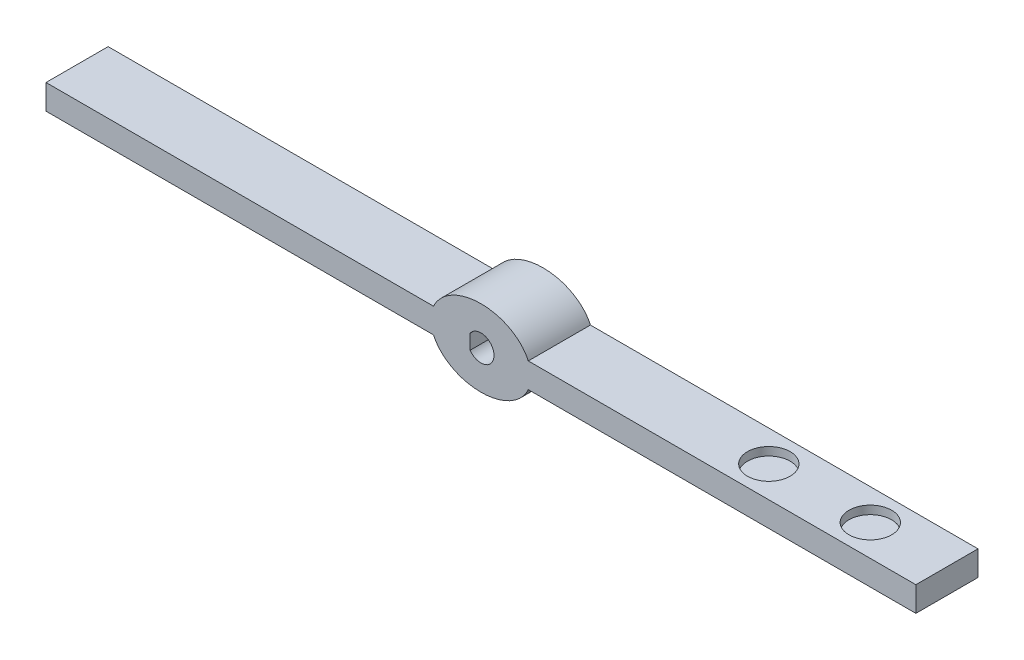
ISO-10303-21;
HEADER;
FILE_DESCRIPTION(('STEP AP214'),'2;1');
FILE_NAME('part.step','',(''),(''),'','','');
FILE_SCHEMA(('AUTOMOTIVE_DESIGN { 1 0 10303 214 1 1 1 1 }'));
ENDSEC;
DATA;
#1=APPLICATION_CONTEXT('core data for automotive mechanical design processes');
#2=APPLICATION_PROTOCOL_DEFINITION('international standard','automotive_design',2000,#1);
#3=PRODUCT_CONTEXT('',#1,'mechanical');
#4=PRODUCT('Part','Part','',(#3));
#5=PRODUCT_RELATED_PRODUCT_CATEGORY('part','',(#4));
#6=PRODUCT_DEFINITION_FORMATION('','',#4);
#7=PRODUCT_DEFINITION_CONTEXT('part definition',#1,'design');
#8=PRODUCT_DEFINITION('design','',#6,#7);
#9=PRODUCT_DEFINITION_SHAPE('','',#8);
#10=(LENGTH_UNIT() NAMED_UNIT(*) SI_UNIT(.MILLI.,.METRE.));
#11=(NAMED_UNIT(*) PLANE_ANGLE_UNIT() SI_UNIT($,.RADIAN.));
#12=(NAMED_UNIT(*) SI_UNIT($,.STERADIAN.) SOLID_ANGLE_UNIT());
#13=UNCERTAINTY_MEASURE_WITH_UNIT(LENGTH_MEASURE(1.E-05),#10,'distance_accuracy_value','');
#14=(GEOMETRIC_REPRESENTATION_CONTEXT(3) GLOBAL_UNCERTAINTY_ASSIGNED_CONTEXT((#13)) GLOBAL_UNIT_ASSIGNED_CONTEXT((#10,
#11,#12)) REPRESENTATION_CONTEXT('',''));
#15=CARTESIAN_POINT('',(0.,0.,0.));
#16=DIRECTION('',(0.,0.,1.));
#17=DIRECTION('',(1.,0.,0.));
#18=AXIS2_PLACEMENT_3D('',#15,#16,#17);
#19=CARTESIAN_POINT('',(-85.2552926525529,15.1830635118306,15.));
#20=DIRECTION('',(0.,1.,0.));
#21=DIRECTION('',(0.,0.,1.));
#22=AXIS2_PLACEMENT_3D('',#19,#20,#21);
#23=PLANE('',#22);
#24=CARTESIAN_POINT('',(-42.2552926525529,15.1830635118306,7.5));
#25=DIRECTION('',(0.,-1.,0.));
#26=DIRECTION('',(0.,0.,-1.));
#27=AXIS2_PLACEMENT_3D('',#24,#25,#26);
#28=CIRCLE('',#27,5.15);
#29=CARTESIAN_POINT('',(-42.2552926525529,15.1830635118306,2.35));
#30=VERTEX_POINT('',#29);
#31=EDGE_CURVE('E144',#30,#30,#28,.T.);
#32=ORIENTED_EDGE('',*,*,#31,.F.);
#33=EDGE_LOOP('',(#32));
#34=FACE_BOUND('',#33,.T.);
#35=CARTESIAN_POINT('',(-66.755292652553,15.1830635118306,7.49999999999983));
#36=DIRECTION('',(0.,-1.,0.));
#37=DIRECTION('',(0.,0.,-1.));
#38=AXIS2_PLACEMENT_3D('',#35,#36,#37);
#39=CIRCLE('',#38,5.15000000000001);
#40=CARTESIAN_POINT('',(-66.755292652553,15.1830635118306,2.34999999999982));
#41=VERTEX_POINT('',#40);
#42=EDGE_CURVE('E205',#41,#41,#39,.T.);
#43=ORIENTED_EDGE('',*,*,#42,.F.);
#44=EDGE_LOOP('',(#43));
#45=FACE_BOUND('',#44,.T.);
#46=DIRECTION('',(1.,0.,0.));
#47=VECTOR('',#46,1.);
#48=CARTESIAN_POINT('',(-85.2552926525529,15.1830635118306,0.));
#49=LINE('',#48,#47);
#50=CARTESIAN_POINT('',(-85.2552926525529,15.1830635118306,0.));
#51=VERTEX_POINT('',#50);
#52=CARTESIAN_POINT('',(8.31177794922894,15.1830635118306,0.));
#53=VERTEX_POINT('',#52);
#54=EDGE_CURVE('E208',#51,#53,#49,.T.);
#55=ORIENTED_EDGE('',*,*,#54,.T.);
#56=DIRECTION('',(0.,0.,1.));
#57=VECTOR('',#56,1.);
#58=CARTESIAN_POINT('',(8.31177794922894,15.1830635118306,0.));
#59=LINE('',#58,#57);
#60=CARTESIAN_POINT('',(8.31177794922894,15.1830635118306,15.));
#61=VERTEX_POINT('',#60);
#62=EDGE_CURVE('E209',#53,#61,#59,.T.);
#63=ORIENTED_EDGE('',*,*,#62,.T.);
#64=DIRECTION('',(1.,0.,0.));
#65=VECTOR('',#64,1.);
#66=CARTESIAN_POINT('',(-85.2552926525529,15.1830635118306,15.));
#67=LINE('',#66,#65);
#68=CARTESIAN_POINT('',(-85.2552926525529,15.1830635118306,15.));
#69=VERTEX_POINT('',#68);
#70=EDGE_CURVE('E263',#69,#61,#67,.T.);
#71=ORIENTED_EDGE('',*,*,#70,.F.);
#72=DIRECTION('',(0.,0.,-1.));
#73=VECTOR('',#72,1.);
#74=CARTESIAN_POINT('',(-85.2552926525529,15.1830635118306,15.));
#75=LINE('',#74,#73);
#76=EDGE_CURVE('E11',#69,#51,#75,.T.);
#77=ORIENTED_EDGE('',*,*,#76,.T.);
#78=EDGE_LOOP('',(#55,#63,#71,#77));
#79=FACE_BOUND('',#78,.T.);
#80=ADVANCED_FACE('F45',(#34,#45,#79),#23,.F.);
#81=CARTESIAN_POINT('',(-85.2552926525529,21.1830635118306,15.));
#82=DIRECTION('',(0.,-1.,0.));
#83=DIRECTION('',(0.,0.,-1.));
#84=AXIS2_PLACEMENT_3D('',#81,#82,#83);
#85=PLANE('',#84);
#86=CARTESIAN_POINT('',(81.7447073474471,21.1830635118306,7.5));
#87=DIRECTION('',(0.,1.,0.));
#88=DIRECTION('',(0.,0.,1.));
#89=AXIS2_PLACEMENT_3D('',#86,#87,#88);
#90=CIRCLE('',#89,5.15);
#91=CARTESIAN_POINT('',(81.7447073474471,21.1830635118306,12.65));
#92=VERTEX_POINT('',#91);
#93=EDGE_CURVE('E408',#92,#92,#90,.T.);
#94=ORIENTED_EDGE('',*,*,#93,.F.);
#95=EDGE_LOOP('',(#94));
#96=FACE_BOUND('',#95,.T.);
#97=CARTESIAN_POINT('',(106.244707347447,21.1830635118306,7.5));
#98=DIRECTION('',(0.,1.,0.));
#99=DIRECTION('',(0.,0.,1.));
#100=AXIS2_PLACEMENT_3D('',#97,#98,#99);
#101=CIRCLE('',#100,5.14999999999998);
#102=CARTESIAN_POINT('',(106.244707347447,21.1830635118306,12.65));
#103=VERTEX_POINT('',#102);
#104=EDGE_CURVE('E414',#103,#103,#101,.T.);
#105=ORIENTED_EDGE('',*,*,#104,.F.);
#106=EDGE_LOOP('',(#105));
#107=FACE_BOUND('',#106,.T.);
#108=DIRECTION('',(-1.,0.,0.));
#109=VECTOR('',#108,1.);
#110=CARTESIAN_POINT('',(-85.2552926525529,21.1830635118306,0.));
#111=LINE('',#110,#109);
#112=CARTESIAN_POINT('',(124.744707347447,21.1830635118306,0.));
#113=VERTEX_POINT('',#112);
#114=CARTESIAN_POINT('',(31.1776367456652,21.1830635118306,0.));
#115=VERTEX_POINT('',#114);
#116=EDGE_CURVE('E228',#113,#115,#111,.T.);
#117=ORIENTED_EDGE('',*,*,#116,.T.);
#118=DIRECTION('',(0.,0.,1.));
#119=VECTOR('',#118,1.);
#120=CARTESIAN_POINT('',(31.1776367456652,21.1830635118306,0.));
#121=LINE('',#120,#119);
#122=CARTESIAN_POINT('',(31.1776367456652,21.1830635118306,15.));
#123=VERTEX_POINT('',#122);
#124=EDGE_CURVE('E255',#115,#123,#121,.T.);
#125=ORIENTED_EDGE('',*,*,#124,.T.);
#126=DIRECTION('',(-1.,0.,0.));
#127=VECTOR('',#126,1.);
#128=CARTESIAN_POINT('',(-85.2552926525529,21.1830635118306,15.));
#129=LINE('',#128,#127);
#130=CARTESIAN_POINT('',(124.744707347447,21.1830635118306,15.));
#131=VERTEX_POINT('',#130);
#132=EDGE_CURVE('E238',#131,#123,#129,.T.);
#133=ORIENTED_EDGE('',*,*,#132,.F.);
#134=DIRECTION('',(0.,0.,-1.));
#135=VECTOR('',#134,1.);
#136=CARTESIAN_POINT('',(124.744707347447,21.1830635118306,15.));
#137=LINE('',#136,#135);
#138=EDGE_CURVE('E237',#131,#113,#137,.T.);
#139=ORIENTED_EDGE('',*,*,#138,.T.);
#140=EDGE_LOOP('',(#117,#125,#133,#139));
#141=FACE_BOUND('',#140,.T.);
#142=ADVANCED_FACE('F180',(#96,#107,#141),#85,.F.);
#143=CARTESIAN_POINT('',(-85.2552926525529,21.1830635118306,15.));
#144=DIRECTION('',(1.,0.,0.));
#145=DIRECTION('',(0.,0.,-1.));
#146=AXIS2_PLACEMENT_3D('',#143,#144,#145);
#147=PLANE('',#146);
#148=DIRECTION('',(0.,-1.,0.));
#149=VECTOR('',#148,1.);
#150=CARTESIAN_POINT('',(-85.2552926525529,21.1830635118306,0.));
#151=LINE('',#150,#149);
#152=CARTESIAN_POINT('',(-85.2552926525529,21.1830635118306,0.));
#153=VERTEX_POINT('',#152);
#154=EDGE_CURVE('E224',#153,#51,#151,.T.);
#155=ORIENTED_EDGE('',*,*,#154,.T.);
#156=ORIENTED_EDGE('',*,*,#76,.F.);
#157=DIRECTION('',(0.,-1.,0.));
#158=VECTOR('',#157,1.);
#159=CARTESIAN_POINT('',(-85.2552926525529,21.1830635118306,15.));
#160=LINE('',#159,#158);
#161=CARTESIAN_POINT('',(-85.2552926525529,21.1830635118306,15.));
#162=VERTEX_POINT('',#161);
#163=EDGE_CURVE('E232',#162,#69,#160,.T.);
#164=ORIENTED_EDGE('',*,*,#163,.F.);
#165=DIRECTION('',(0.,0.,-1.));
#166=VECTOR('',#165,1.);
#167=CARTESIAN_POINT('',(-85.2552926525529,21.1830635118306,15.));
#168=LINE('',#167,#166);
#169=EDGE_CURVE('E233',#162,#153,#168,.T.);
#170=ORIENTED_EDGE('',*,*,#169,.T.);
#171=EDGE_LOOP('',(#155,#156,#164,#170));
#172=FACE_BOUND('',#171,.T.);
#173=ADVANCED_FACE('F47',(#172),#147,.F.);
#174=CARTESIAN_POINT('',(31.1776367456652,15.1830635118306,15.));
#175=VERTEX_POINT('',#174);
#176=CARTESIAN_POINT('',(124.744707347447,15.1830635118306,15.));
#177=VERTEX_POINT('',#176);
#178=EDGE_CURVE('E266',#175,#177,#67,.T.);
#179=ORIENTED_EDGE('',*,*,#178,.F.);
#180=DIRECTION('',(0.,0.,1.));
#181=VECTOR('',#180,1.);
#182=CARTESIAN_POINT('',(31.1776367456652,15.1830635118306,0.));
#183=LINE('',#182,#181);
#184=CARTESIAN_POINT('',(31.1776367456652,15.1830635118306,0.));
#185=VERTEX_POINT('',#184);
#186=EDGE_CURVE('E272',#175,#185,#183,.F.);
#187=ORIENTED_EDGE('',*,*,#186,.T.);
#188=CARTESIAN_POINT('',(124.744707347447,15.1830635118306,0.));
#189=VERTEX_POINT('',#188);
#190=EDGE_CURVE('E218',#185,#189,#49,.T.);
#191=ORIENTED_EDGE('',*,*,#190,.T.);
#192=DIRECTION('',(0.,0.,-1.));
#193=VECTOR('',#192,1.);
#194=CARTESIAN_POINT('',(124.744707347447,15.1830635118306,15.));
#195=LINE('',#194,#193);
#196=EDGE_CURVE('E54',#177,#189,#195,.T.);
#197=ORIENTED_EDGE('',*,*,#196,.F.);
#198=EDGE_LOOP('',(#179,#187,#191,#197));
#199=FACE_BOUND('',#198,.T.);
#200=ADVANCED_FACE('F182',(#199),#23,.F.);
#201=CARTESIAN_POINT('',(124.744707347447,21.1830635118306,15.));
#202=DIRECTION('',(-1.,0.,0.));
#203=DIRECTION('',(0.,-1.,0.));
#204=AXIS2_PLACEMENT_3D('',#201,#202,#203);
#205=PLANE('',#204);
#206=DIRECTION('',(0.,1.,0.));
#207=VECTOR('',#206,1.);
#208=CARTESIAN_POINT('',(124.744707347447,21.1830635118306,0.));
#209=LINE('',#208,#207);
#210=EDGE_CURVE('E217',#189,#113,#209,.T.);
#211=ORIENTED_EDGE('',*,*,#210,.T.);
#212=ORIENTED_EDGE('',*,*,#138,.F.);
#213=DIRECTION('',(0.,1.,0.));
#214=VECTOR('',#213,1.);
#215=CARTESIAN_POINT('',(124.744707347447,21.1830635118306,15.));
#216=LINE('',#215,#214);
#217=EDGE_CURVE('E247',#177,#131,#216,.T.);
#218=ORIENTED_EDGE('',*,*,#217,.F.);
#219=ORIENTED_EDGE('',*,*,#196,.T.);
#220=EDGE_LOOP('',(#211,#212,#218,#219));
#221=FACE_BOUND('',#220,.T.);
#222=ADVANCED_FACE('F178',(#221),#205,.F.);
#223=CARTESIAN_POINT('',(8.31177794922894,21.1830635118306,15.));
#224=VERTEX_POINT('',#223);
#225=EDGE_CURVE('E258',#224,#162,#129,.T.);
#226=ORIENTED_EDGE('',*,*,#225,.F.);
#227=DIRECTION('',(0.,0.,1.));
#228=VECTOR('',#227,1.);
#229=CARTESIAN_POINT('',(8.31177794922894,21.1830635118306,0.));
#230=LINE('',#229,#228);
#231=CARTESIAN_POINT('',(8.31177794922894,21.1830635118306,0.));
#232=VERTEX_POINT('',#231);
#233=EDGE_CURVE('E157',#224,#232,#230,.F.);
#234=ORIENTED_EDGE('',*,*,#233,.T.);
#235=EDGE_CURVE('E222',#232,#153,#111,.T.);
#236=ORIENTED_EDGE('',*,*,#235,.T.);
#237=ORIENTED_EDGE('',*,*,#169,.F.);
#238=EDGE_LOOP('',(#226,#234,#236,#237));
#239=FACE_BOUND('',#238,.T.);
#240=ADVANCED_FACE('F172',(#239),#85,.F.);
#241=CARTESIAN_POINT('',(0.,0.,15.));
#242=DIRECTION('',(0.,0.,1.));
#243=DIRECTION('',(1.,0.,0.));
#244=AXIS2_PLACEMENT_3D('',#241,#242,#243);
#245=PLANE('',#244);
#246=CARTESIAN_POINT('',(19.7447073474471,18.1830635118306,15.));
#247=DIRECTION('',(0.,0.,1.));
#248=DIRECTION('',(1.,0.,0.));
#249=AXIS2_PLACEMENT_3D('',#246,#247,#248);
#250=CIRCLE('',#249,3.15);
#251=CARTESIAN_POINT('',(17.1447073474471,16.4047215874528,15.));
#252=VERTEX_POINT('',#251);
#253=CARTESIAN_POINT('',(17.1447073474471,19.9614054362085,15.));
#254=VERTEX_POINT('',#253);
#255=EDGE_CURVE('E61',#252,#254,#250,.T.);
#256=ORIENTED_EDGE('',*,*,#255,.F.);
#257=DIRECTION('',(0.,1.,0.));
#258=VECTOR('',#257,1.);
#259=CARTESIAN_POINT('',(17.1447073474471,19.9614054362085,15.));
#260=LINE('',#259,#258);
#261=EDGE_CURVE('E124',#252,#254,#260,.T.);
#262=ORIENTED_EDGE('',*,*,#261,.T.);
#263=EDGE_LOOP('',(#256,#262));
#264=FACE_BOUND('',#263,.T.);
#265=ORIENTED_EDGE('',*,*,#132,.T.);
#266=CARTESIAN_POINT('',(19.7447073474471,18.1830635118306,15.));
#267=DIRECTION('',(0.,0.,1.));
#268=DIRECTION('',(1.,0.,0.));
#269=AXIS2_PLACEMENT_3D('',#266,#267,#268);
#270=ELLIPSE('',#269,12.0847953481925,9.25941938993618);
#271=EDGE_CURVE('E159',#123,#224,#270,.T.);
#272=ORIENTED_EDGE('',*,*,#271,.T.);
#273=ORIENTED_EDGE('',*,*,#225,.T.);
#274=ORIENTED_EDGE('',*,*,#163,.T.);
#275=ORIENTED_EDGE('',*,*,#70,.T.);
#276=EDGE_CURVE('E151',#61,#175,#270,.T.);
#277=ORIENTED_EDGE('',*,*,#276,.T.);
#278=ORIENTED_EDGE('',*,*,#178,.T.);
#279=ORIENTED_EDGE('',*,*,#217,.T.);
#280=EDGE_LOOP('',(#265,#272,#273,#274,#275,#277,#278,#279));
#281=FACE_BOUND('',#280,.T.);
#282=ADVANCED_FACE('F121',(#264,#281),#245,.T.);
#283=CARTESIAN_POINT('',(0.,0.,0.));
#284=DIRECTION('',(0.,0.,1.));
#285=DIRECTION('',(1.,0.,0.));
#286=AXIS2_PLACEMENT_3D('',#283,#284,#285);
#287=PLANE('',#286);
#288=CARTESIAN_POINT('',(19.7447073474471,18.1830635118306,0.));
#289=DIRECTION('',(0.,0.,1.));
#290=DIRECTION('',(1.,0.,0.));
#291=AXIS2_PLACEMENT_3D('',#288,#289,#290);
#292=CIRCLE('',#291,3.15);
#293=CARTESIAN_POINT('',(17.1447073474472,16.4047215874527,0.));
#294=VERTEX_POINT('',#293);
#295=CARTESIAN_POINT('',(17.1447073474471,19.9614054362085,0.));
#296=VERTEX_POINT('',#295);
#297=EDGE_CURVE('E66',#294,#296,#292,.T.);
#298=ORIENTED_EDGE('',*,*,#297,.T.);
#299=DIRECTION('',(0.,1.,0.));
#300=VECTOR('',#299,1.);
#301=CARTESIAN_POINT('',(17.1447073474471,19.9614054362085,0.));
#302=LINE('',#301,#300);
#303=EDGE_CURVE('E134',#294,#296,#302,.T.);
#304=ORIENTED_EDGE('',*,*,#303,.F.);
#305=EDGE_LOOP('',(#298,#304));
#306=FACE_BOUND('',#305,.T.);
#307=ORIENTED_EDGE('',*,*,#190,.F.);
#308=CARTESIAN_POINT('',(19.7447073474471,18.1830635118306,0.));
#309=DIRECTION('',(0.,0.,1.));
#310=DIRECTION('',(1.,0.,0.));
#311=AXIS2_PLACEMENT_3D('',#308,#309,#310);
#312=ELLIPSE('',#311,12.0847953481925,9.25941938993618);
#313=EDGE_CURVE('E158',#53,#185,#312,.T.);
#314=ORIENTED_EDGE('',*,*,#313,.F.);
#315=ORIENTED_EDGE('',*,*,#54,.F.);
#316=ORIENTED_EDGE('',*,*,#154,.F.);
#317=ORIENTED_EDGE('',*,*,#235,.F.);
#318=EDGE_CURVE('E153',#115,#232,#312,.T.);
#319=ORIENTED_EDGE('',*,*,#318,.F.);
#320=ORIENTED_EDGE('',*,*,#116,.F.);
#321=ORIENTED_EDGE('',*,*,#210,.F.);
#322=EDGE_LOOP('',(#307,#314,#315,#316,#317,#319,#320,#321));
#323=FACE_BOUND('',#322,.T.);
#324=ADVANCED_FACE('F171',(#306,#323),#287,.F.);
#325=DIRECTION('',(0.,0.,1.));
#326=VECTOR('',#325,1.);
#327=SURFACE_OF_LINEAR_EXTRUSION('',#312,#326);
#328=ORIENTED_EDGE('',*,*,#124,.F.);
#329=ORIENTED_EDGE('',*,*,#318,.T.);
#330=ORIENTED_EDGE('',*,*,#233,.F.);
#331=ORIENTED_EDGE('',*,*,#271,.F.);
#332=EDGE_LOOP('',(#328,#329,#330,#331));
#333=FACE_BOUND('',#332,.T.);
#334=ADVANCED_FACE('F166',(#333),#327,.T.);
#335=ORIENTED_EDGE('',*,*,#62,.F.);
#336=ORIENTED_EDGE('',*,*,#313,.T.);
#337=ORIENTED_EDGE('',*,*,#186,.F.);
#338=ORIENTED_EDGE('',*,*,#276,.F.);
#339=EDGE_LOOP('',(#335,#336,#337,#338));
#340=FACE_BOUND('',#339,.T.);
#341=ADVANCED_FACE('F162',(#340),#327,.T.);
#342=CARTESIAN_POINT('',(19.7447073474471,18.1830635118306,0.));
#343=DIRECTION('',(0.,0.,1.));
#344=DIRECTION('',(1.,0.,0.));
#345=AXIS2_PLACEMENT_3D('',#342,#343,#344);
#346=CYLINDRICAL_SURFACE('',#345,3.15);
#347=ORIENTED_EDGE('',*,*,#255,.T.);
#348=DIRECTION('',(0.,0.,1.));
#349=VECTOR('',#348,1.);
#350=CARTESIAN_POINT('',(17.1447073474471,19.9614054362085,0.));
#351=LINE('',#350,#349);
#352=EDGE_CURVE('E126',#296,#254,#351,.T.);
#353=ORIENTED_EDGE('',*,*,#352,.F.);
#354=ORIENTED_EDGE('',*,*,#297,.F.);
#355=DIRECTION('',(0.,0.,1.));
#356=VECTOR('',#355,1.);
#357=CARTESIAN_POINT('',(17.1447073474471,16.4047215874528,0.));
#358=LINE('',#357,#356);
#359=EDGE_CURVE('E128',#294,#252,#358,.T.);
#360=ORIENTED_EDGE('',*,*,#359,.T.);
#361=EDGE_LOOP('',(#347,#353,#354,#360));
#362=FACE_BOUND('',#361,.T.);
#363=ADVANCED_FACE('F129',(#362),#346,.F.);
#364=CARTESIAN_POINT('',(17.1447073474471,19.9614054362085,0.));
#365=DIRECTION('',(1.,0.,0.));
#366=DIRECTION('',(0.,0.,-1.));
#367=AXIS2_PLACEMENT_3D('',#364,#365,#366);
#368=PLANE('',#367);
#369=ORIENTED_EDGE('',*,*,#261,.F.);
#370=ORIENTED_EDGE('',*,*,#359,.F.);
#371=ORIENTED_EDGE('',*,*,#303,.T.);
#372=ORIENTED_EDGE('',*,*,#352,.T.);
#373=EDGE_LOOP('',(#369,#370,#371,#372));
#374=FACE_BOUND('',#373,.T.);
#375=ADVANCED_FACE('F136',(#374),#368,.T.);
#376=CARTESIAN_POINT('',(-66.755292652553,17.1830635118306,7.49999999999983));
#377=DIRECTION('',(0.,-1.,0.));
#378=DIRECTION('',(0.,0.,-1.));
#379=AXIS2_PLACEMENT_3D('',#376,#377,#378);
#380=CYLINDRICAL_SURFACE('',#379,5.15000000000001);
#381=CARTESIAN_POINT('',(-66.755292652553,17.1830635118306,7.49999999999983));
#382=DIRECTION('',(0.,-1.,0.));
#383=DIRECTION('',(0.,0.,-1.));
#384=AXIS2_PLACEMENT_3D('',#381,#382,#383);
#385=CIRCLE('',#384,5.15000000000001);
#386=CARTESIAN_POINT('',(-66.755292652553,17.1830635118306,2.34999999999982));
#387=VERTEX_POINT('',#386);
#388=EDGE_CURVE('E407',#387,#387,#385,.T.);
#389=ORIENTED_EDGE('',*,*,#388,.F.);
#390=EDGE_LOOP('',(#389));
#391=FACE_BOUND('',#390,.T.);
#392=ORIENTED_EDGE('',*,*,#42,.T.);
#393=EDGE_LOOP('',(#392));
#394=FACE_BOUND('',#393,.T.);
#395=ADVANCED_FACE('F320',(#391,#394),#380,.F.);
#396=CARTESIAN_POINT('',(-66.755292652553,17.1830635118306,7.49999999999983));
#397=DIRECTION('',(0.,-1.,0.));
#398=DIRECTION('',(0.,0.,-1.));
#399=AXIS2_PLACEMENT_3D('',#396,#397,#398);
#400=PLANE('',#399);
#401=ORIENTED_EDGE('',*,*,#388,.T.);
#402=EDGE_LOOP('',(#401));
#403=FACE_BOUND('',#402,.T.);
#404=ADVANCED_FACE('F330',(#403),#400,.T.);
#405=CARTESIAN_POINT('',(-42.2552926525529,17.1830635118306,7.5));
#406=DIRECTION('',(0.,-1.,0.));
#407=DIRECTION('',(0.,0.,-1.));
#408=AXIS2_PLACEMENT_3D('',#405,#406,#407);
#409=CYLINDRICAL_SURFACE('',#408,5.15);
#410=CARTESIAN_POINT('',(-42.2552926525529,17.1830635118306,7.5));
#411=DIRECTION('',(0.,-1.,0.));
#412=DIRECTION('',(0.,0.,-1.));
#413=AXIS2_PLACEMENT_3D('',#410,#411,#412);
#414=CIRCLE('',#413,5.15);
#415=CARTESIAN_POINT('',(-42.2552926525529,17.1830635118306,2.35));
#416=VERTEX_POINT('',#415);
#417=EDGE_CURVE('E138',#416,#416,#414,.T.);
#418=ORIENTED_EDGE('',*,*,#417,.F.);
#419=EDGE_LOOP('',(#418));
#420=FACE_BOUND('',#419,.T.);
#421=ORIENTED_EDGE('',*,*,#31,.T.);
#422=EDGE_LOOP('',(#421));
#423=FACE_BOUND('',#422,.T.);
#424=ADVANCED_FACE('F340',(#420,#423),#409,.F.);
#425=CARTESIAN_POINT('',(-42.2552926525529,17.1830635118306,7.5));
#426=DIRECTION('',(0.,-1.,0.));
#427=DIRECTION('',(0.,0.,-1.));
#428=AXIS2_PLACEMENT_3D('',#425,#426,#427);
#429=PLANE('',#428);
#430=ORIENTED_EDGE('',*,*,#417,.T.);
#431=EDGE_LOOP('',(#430));
#432=FACE_BOUND('',#431,.T.);
#433=ADVANCED_FACE('F350',(#432),#429,.T.);
#434=CARTESIAN_POINT('',(106.244707347447,19.1830635118306,7.5));
#435=DIRECTION('',(0.,1.,0.));
#436=DIRECTION('',(0.,0.,1.));
#437=AXIS2_PLACEMENT_3D('',#434,#435,#436);
#438=CYLINDRICAL_SURFACE('',#437,5.14999999999998);
#439=CARTESIAN_POINT('',(106.244707347447,19.1830635118306,7.5));
#440=DIRECTION('',(0.,1.,0.));
#441=DIRECTION('',(0.,0.,1.));
#442=AXIS2_PLACEMENT_3D('',#439,#440,#441);
#443=CIRCLE('',#442,5.14999999999998);
#444=CARTESIAN_POINT('',(106.244707347447,19.1830635118306,12.65));
#445=VERTEX_POINT('',#444);
#446=EDGE_CURVE('E420',#445,#445,#443,.T.);
#447=ORIENTED_EDGE('',*,*,#446,.F.);
#448=EDGE_LOOP('',(#447));
#449=FACE_BOUND('',#448,.T.);
#450=ORIENTED_EDGE('',*,*,#104,.T.);
#451=EDGE_LOOP('',(#450));
#452=FACE_BOUND('',#451,.T.);
#453=ADVANCED_FACE('F360',(#449,#452),#438,.F.);
#454=CARTESIAN_POINT('',(106.244707347447,19.1830635118306,7.5));
#455=DIRECTION('',(0.,1.,0.));
#456=DIRECTION('',(0.,0.,1.));
#457=AXIS2_PLACEMENT_3D('',#454,#455,#456);
#458=PLANE('',#457);
#459=ORIENTED_EDGE('',*,*,#446,.T.);
#460=EDGE_LOOP('',(#459));
#461=FACE_BOUND('',#460,.T.);
#462=ADVANCED_FACE('F370',(#461),#458,.T.);
#463=CARTESIAN_POINT('',(81.7447073474471,19.1830635118306,7.5));
#464=DIRECTION('',(0.,1.,0.));
#465=DIRECTION('',(0.,0.,1.));
#466=AXIS2_PLACEMENT_3D('',#463,#464,#465);
#467=CYLINDRICAL_SURFACE('',#466,5.15);
#468=CARTESIAN_POINT('',(81.7447073474471,19.1830635118306,7.5));
#469=DIRECTION('',(0.,1.,0.));
#470=DIRECTION('',(0.,0.,1.));
#471=AXIS2_PLACEMENT_3D('',#468,#469,#470);
#472=CIRCLE('',#471,5.15);
#473=CARTESIAN_POINT('',(81.7447073474471,19.1830635118306,12.65));
#474=VERTEX_POINT('',#473);
#475=EDGE_CURVE('E405',#474,#474,#472,.T.);
#476=ORIENTED_EDGE('',*,*,#475,.F.);
#477=EDGE_LOOP('',(#476));
#478=FACE_BOUND('',#477,.T.);
#479=ORIENTED_EDGE('',*,*,#93,.T.);
#480=EDGE_LOOP('',(#479));
#481=FACE_BOUND('',#480,.T.);
#482=ADVANCED_FACE('F380',(#478,#481),#467,.F.);
#483=CARTESIAN_POINT('',(81.7447073474471,19.1830635118306,7.5));
#484=DIRECTION('',(0.,1.,0.));
#485=DIRECTION('',(0.,0.,1.));
#486=AXIS2_PLACEMENT_3D('',#483,#484,#485);
#487=PLANE('',#486);
#488=ORIENTED_EDGE('',*,*,#475,.T.);
#489=EDGE_LOOP('',(#488));
#490=FACE_BOUND('',#489,.T.);
#491=ADVANCED_FACE('F390',(#490),#487,.T.);
#492=CLOSED_SHELL('',(#80,#142,#173,#200,#222,#240,#282,#324,#334,#341,#363,#375,#395,#404,#424,
#433,#453,#462,#482,#491));
#493=MANIFOLD_SOLID_BREP('B2',#492);
#494=ADVANCED_BREP_SHAPE_REPRESENTATION('',(#18,#493),#14);
#495=SHAPE_DEFINITION_REPRESENTATION(#9,#494);
ENDSEC;
END-ISO-10303-21;
